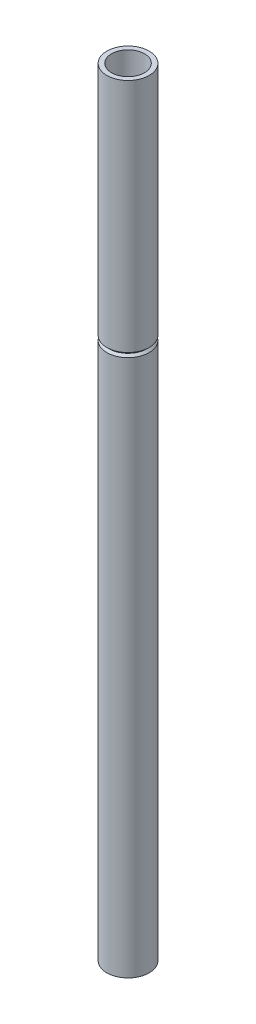
ISO-10303-21;
HEADER;
FILE_DESCRIPTION(('STEP AP214'),'2;1');
FILE_NAME('part.step','',(''),(''),'','','');
FILE_SCHEMA(('AUTOMOTIVE_DESIGN { 1 0 10303 214 1 1 1 1 }'));
ENDSEC;
DATA;
#1=APPLICATION_CONTEXT('core data for automotive mechanical design processes');
#2=APPLICATION_PROTOCOL_DEFINITION('international standard','automotive_design',2000,#1);
#3=PRODUCT_CONTEXT('',#1,'mechanical');
#4=PRODUCT('Part','Part','',(#3));
#5=PRODUCT_RELATED_PRODUCT_CATEGORY('part','',(#4));
#6=PRODUCT_DEFINITION_FORMATION('','',#4);
#7=PRODUCT_DEFINITION_CONTEXT('part definition',#1,'design');
#8=PRODUCT_DEFINITION('design','',#6,#7);
#9=PRODUCT_DEFINITION_SHAPE('','',#8);
#10=(LENGTH_UNIT() NAMED_UNIT(*) SI_UNIT(.MILLI.,.METRE.));
#11=(NAMED_UNIT(*) PLANE_ANGLE_UNIT() SI_UNIT($,.RADIAN.));
#12=(NAMED_UNIT(*) SI_UNIT($,.STERADIAN.) SOLID_ANGLE_UNIT());
#13=UNCERTAINTY_MEASURE_WITH_UNIT(LENGTH_MEASURE(1.E-05),#10,'distance_accuracy_value','');
#14=(GEOMETRIC_REPRESENTATION_CONTEXT(3) GLOBAL_UNCERTAINTY_ASSIGNED_CONTEXT((#13)) GLOBAL_UNIT_ASSIGNED_CONTEXT((#10,
#11,#12)) REPRESENTATION_CONTEXT('',''));
#15=CARTESIAN_POINT('',(0.,0.,0.));
#16=DIRECTION('',(0.,0.,1.));
#17=DIRECTION('',(1.,0.,0.));
#18=AXIS2_PLACEMENT_3D('',#15,#16,#17);
#19=CARTESIAN_POINT('',(0.,0.106318699362486,0.));
#20=DIRECTION('',(0.,1.,0.));
#21=DIRECTION('',(0.,0.,1.));
#22=AXIS2_PLACEMENT_3D('',#19,#20,#21);
#23=CONICAL_SURFACE('',#22,0.53,1.23320369806911);
#24=CARTESIAN_POINT('',(0.,-0.0457218100560409,0.));
#25=DIRECTION('',(0.,-1.,0.));
#26=DIRECTION('',(0.,0.,-1.));
#27=AXIS2_PLACEMENT_3D('',#24,#25,#26);
#28=CIRCLE('',#27,0.0968738810673313);
#29=CARTESIAN_POINT('',(0.,-0.0457218100560409,-0.0968738810673313));
#30=VERTEX_POINT('',#29);
#31=EDGE_CURVE('E71',#30,#30,#28,.T.);
#32=ORIENTED_EDGE('',*,*,#31,.T.);
#33=EDGE_LOOP('',(#32));
#34=FACE_BOUND('',#33,.T.);
#35=CARTESIAN_POINT('',(0.,0.106318699362486,0.));
#36=DIRECTION('',(0.,-1.,0.));
#37=DIRECTION('',(0.,0.,-1.));
#38=AXIS2_PLACEMENT_3D('',#35,#36,#37);
#39=CIRCLE('',#38,0.53);
#40=CARTESIAN_POINT('',(0.,0.106318699362486,-0.53));
#41=VERTEX_POINT('',#40);
#42=EDGE_CURVE('E10',#41,#41,#39,.T.);
#43=ORIENTED_EDGE('',*,*,#42,.F.);
#44=EDGE_LOOP('',(#43));
#45=FACE_BOUND('',#44,.T.);
#46=ADVANCED_FACE('F31',(#34,#45),#23,.F.);
#47=CARTESIAN_POINT('',(0.,0.,0.));
#48=DIRECTION('',(0.,-1.,0.));
#49=DIRECTION('',(0.,0.,-1.));
#50=AXIS2_PLACEMENT_3D('',#47,#48,#49);
#51=CYLINDRICAL_SURFACE('',#50,0.529999999999999);
#52=ORIENTED_EDGE('',*,*,#42,.T.);
#53=EDGE_LOOP('',(#52));
#54=FACE_BOUND('',#53,.T.);
#55=CARTESIAN_POINT('',(0.,17.2171572875254,0.));
#56=DIRECTION('',(0.,-1.,0.));
#57=DIRECTION('',(0.,0.,-1.));
#58=AXIS2_PLACEMENT_3D('',#55,#56,#57);
#59=CIRCLE('',#58,0.529999999999998);
#60=CARTESIAN_POINT('',(0.,17.2171572875254,-0.529999999999998));
#61=VERTEX_POINT('',#60);
#62=EDGE_CURVE('E37',#61,#61,#59,.T.);
#63=ORIENTED_EDGE('',*,*,#62,.F.);
#64=EDGE_LOOP('',(#63));
#65=FACE_BOUND('',#64,.T.);
#66=ADVANCED_FACE('F131',(#54,#65),#51,.F.);
#67=CARTESIAN_POINT('',(0.,17.35,0.));
#68=DIRECTION('',(0.,-1.,0.));
#69=DIRECTION('',(0.,0.,-1.));
#70=AXIS2_PLACEMENT_3D('',#67,#68,#69);
#71=CONICAL_SURFACE('',#70,0.397157287525377,0.785398163397457);
#72=ORIENTED_EDGE('',*,*,#62,.T.);
#73=EDGE_LOOP('',(#72));
#74=FACE_BOUND('',#73,.T.);
#75=CARTESIAN_POINT('',(0.,17.35,0.));
#76=DIRECTION('',(0.,-1.,0.));
#77=DIRECTION('',(0.,0.,-1.));
#78=AXIS2_PLACEMENT_3D('',#75,#76,#77);
#79=CIRCLE('',#78,0.397157287525377);
#80=CARTESIAN_POINT('',(0.,17.35,-0.397157287525377));
#81=VERTEX_POINT('',#80);
#82=EDGE_CURVE('E41',#81,#81,#79,.T.);
#83=ORIENTED_EDGE('',*,*,#82,.F.);
#84=EDGE_LOOP('',(#83));
#85=FACE_BOUND('',#84,.T.);
#86=ADVANCED_FACE('F127',(#74,#85),#71,.F.);
#87=CARTESIAN_POINT('',(0.,17.4828427124746,0.));
#88=DIRECTION('',(0.,1.,0.));
#89=DIRECTION('',(0.,0.,1.));
#90=AXIS2_PLACEMENT_3D('',#87,#88,#89);
#91=CONICAL_SURFACE('',#90,0.529999999999998,0.785398163397457);
#92=ORIENTED_EDGE('',*,*,#82,.T.);
#93=EDGE_LOOP('',(#92));
#94=FACE_BOUND('',#93,.T.);
#95=CARTESIAN_POINT('',(0.,17.4828427124746,0.));
#96=DIRECTION('',(0.,-1.,0.));
#97=DIRECTION('',(0.,0.,-1.));
#98=AXIS2_PLACEMENT_3D('',#95,#96,#97);
#99=CIRCLE('',#98,0.529999999999998);
#100=CARTESIAN_POINT('',(0.,17.4828427124746,-0.529999999999998));
#101=VERTEX_POINT('',#100);
#102=EDGE_CURVE('E45',#101,#101,#99,.T.);
#103=ORIENTED_EDGE('',*,*,#102,.F.);
#104=EDGE_LOOP('',(#103));
#105=FACE_BOUND('',#104,.T.);
#106=ADVANCED_FACE('F121',(#94,#105),#91,.F.);
#107=CARTESIAN_POINT('',(0.,0.,0.));
#108=DIRECTION('',(0.,-1.,0.));
#109=DIRECTION('',(0.,0.,-1.));
#110=AXIS2_PLACEMENT_3D('',#107,#108,#109);
#111=CYLINDRICAL_SURFACE('',#110,0.529999999999998);
#112=ORIENTED_EDGE('',*,*,#102,.T.);
#113=EDGE_LOOP('',(#112));
#114=FACE_BOUND('',#113,.T.);
#115=CARTESIAN_POINT('',(0.,25.,0.));
#116=DIRECTION('',(0.,-1.,0.));
#117=DIRECTION('',(0.,0.,-1.));
#118=AXIS2_PLACEMENT_3D('',#115,#116,#117);
#119=CIRCLE('',#118,0.529999999999997);
#120=CARTESIAN_POINT('',(0.,25.,-0.529999999999997));
#121=VERTEX_POINT('',#120);
#122=EDGE_CURVE('E50',#121,#121,#119,.T.);
#123=ORIENTED_EDGE('',*,*,#122,.F.);
#124=EDGE_LOOP('',(#123));
#125=FACE_BOUND('',#124,.T.);
#126=ADVANCED_FACE('F116',(#114,#125),#111,.F.);
#127=CARTESIAN_POINT('',(0.529999999999997,25.,0.));
#128=DIRECTION('',(0.,-1.,0.));
#129=DIRECTION('',(0.,0.,-1.));
#130=AXIS2_PLACEMENT_3D('',#127,#128,#129);
#131=PLANE('',#130);
#132=CARTESIAN_POINT('',(0.,25.,0.));
#133=DIRECTION('',(0.,-1.,0.));
#134=DIRECTION('',(0.,0.,-1.));
#135=AXIS2_PLACEMENT_3D('',#132,#133,#134);
#136=CIRCLE('',#135,0.679999999999997);
#137=CARTESIAN_POINT('',(0.,25.,-0.679999999999997));
#138=VERTEX_POINT('',#137);
#139=EDGE_CURVE('E53',#138,#138,#136,.T.);
#140=ORIENTED_EDGE('',*,*,#139,.F.);
#141=EDGE_LOOP('',(#140));
#142=FACE_BOUND('',#141,.T.);
#143=ORIENTED_EDGE('',*,*,#122,.T.);
#144=EDGE_LOOP('',(#143));
#145=FACE_BOUND('',#144,.T.);
#146=ADVANCED_FACE('F110',(#142,#145),#131,.F.);
#147=CARTESIAN_POINT('',(0.,0.,0.));
#148=DIRECTION('',(0.,-1.,0.));
#149=DIRECTION('',(0.,0.,-1.));
#150=AXIS2_PLACEMENT_3D('',#147,#148,#149);
#151=CYLINDRICAL_SURFACE('',#150,0.679999999999998);
#152=CARTESIAN_POINT('',(0.,17.4207106781187,0.));
#153=DIRECTION('',(0.,-1.,0.));
#154=DIRECTION('',(0.,0.,-1.));
#155=AXIS2_PLACEMENT_3D('',#152,#153,#154);
#156=CIRCLE('',#155,0.679999999999998);
#157=CARTESIAN_POINT('',(0.,17.4207106781187,-0.679999999999998));
#158=VERTEX_POINT('',#157);
#159=EDGE_CURVE('E56',#158,#158,#156,.T.);
#160=ORIENTED_EDGE('',*,*,#159,.F.);
#161=EDGE_LOOP('',(#160));
#162=FACE_BOUND('',#161,.T.);
#163=ORIENTED_EDGE('',*,*,#139,.T.);
#164=EDGE_LOOP('',(#163));
#165=FACE_BOUND('',#164,.T.);
#166=ADVANCED_FACE('F104',(#162,#165),#151,.T.);
#167=CARTESIAN_POINT('',(0.,17.4207106781187,0.));
#168=DIRECTION('',(0.,1.,0.));
#169=DIRECTION('',(0.,0.,1.));
#170=AXIS2_PLACEMENT_3D('',#167,#168,#169);
#171=CONICAL_SURFACE('',#170,0.679999999999998,0.785398163397458);
#172=CARTESIAN_POINT('',(0.,17.35,0.));
#173=DIRECTION('',(0.,-1.,0.));
#174=DIRECTION('',(0.,0.,-1.));
#175=AXIS2_PLACEMENT_3D('',#172,#173,#174);
#176=CIRCLE('',#175,0.609289321881344);
#177=CARTESIAN_POINT('',(0.,17.35,-0.609289321881344));
#178=VERTEX_POINT('',#177);
#179=EDGE_CURVE('E59',#178,#178,#176,.T.);
#180=ORIENTED_EDGE('',*,*,#179,.F.);
#181=EDGE_LOOP('',(#180));
#182=FACE_BOUND('',#181,.T.);
#183=ORIENTED_EDGE('',*,*,#159,.T.);
#184=EDGE_LOOP('',(#183));
#185=FACE_BOUND('',#184,.T.);
#186=ADVANCED_FACE('F98',(#182,#185),#171,.T.);
#187=CARTESIAN_POINT('',(0.,17.35,0.));
#188=DIRECTION('',(0.,-1.,0.));
#189=DIRECTION('',(0.,0.,-1.));
#190=AXIS2_PLACEMENT_3D('',#187,#188,#189);
#191=CONICAL_SURFACE('',#190,0.609289321881344,0.785398163397458);
#192=CARTESIAN_POINT('',(0.,17.2792893218813,0.));
#193=DIRECTION('',(0.,-1.,0.));
#194=DIRECTION('',(0.,0.,-1.));
#195=AXIS2_PLACEMENT_3D('',#192,#193,#194);
#196=CIRCLE('',#195,0.679999999999998);
#197=CARTESIAN_POINT('',(0.,17.2792893218813,-0.679999999999998));
#198=VERTEX_POINT('',#197);
#199=EDGE_CURVE('E62',#198,#198,#196,.T.);
#200=ORIENTED_EDGE('',*,*,#199,.F.);
#201=EDGE_LOOP('',(#200));
#202=FACE_BOUND('',#201,.T.);
#203=ORIENTED_EDGE('',*,*,#179,.T.);
#204=EDGE_LOOP('',(#203));
#205=FACE_BOUND('',#204,.T.);
#206=ADVANCED_FACE('F92',(#202,#205),#191,.T.);
#207=CARTESIAN_POINT('',(0.,0.,0.));
#208=DIRECTION('',(0.,-1.,0.));
#209=DIRECTION('',(0.,0.,-1.));
#210=AXIS2_PLACEMENT_3D('',#207,#208,#209);
#211=CYLINDRICAL_SURFACE('',#210,0.679999999999999);
#212=CARTESIAN_POINT('',(0.,0.,0.));
#213=DIRECTION('',(0.,-1.,0.));
#214=DIRECTION('',(0.,0.,-1.));
#215=AXIS2_PLACEMENT_3D('',#212,#213,#214);
#216=CIRCLE('',#215,0.68);
#217=CARTESIAN_POINT('',(0.,0.,-0.68));
#218=VERTEX_POINT('',#217);
#219=EDGE_CURVE('E65',#218,#218,#216,.T.);
#220=ORIENTED_EDGE('',*,*,#219,.F.);
#221=EDGE_LOOP('',(#220));
#222=FACE_BOUND('',#221,.T.);
#223=ORIENTED_EDGE('',*,*,#199,.T.);
#224=EDGE_LOOP('',(#223));
#225=FACE_BOUND('',#224,.T.);
#226=ADVANCED_FACE('F86',(#222,#225),#211,.T.);
#227=CARTESIAN_POINT('',(0.,0.,0.));
#228=DIRECTION('',(0.,1.,0.));
#229=DIRECTION('',(0.,0.,1.));
#230=AXIS2_PLACEMENT_3D('',#227,#228,#229);
#231=CONICAL_SURFACE('',#230,0.68,1.23320369806911);
#232=CARTESIAN_POINT('',(0.,-0.187255024080457,0.));
#233=DIRECTION('',(0.,-1.,0.));
#234=DIRECTION('',(0.,0.,-1.));
#235=AXIS2_PLACEMENT_3D('',#232,#233,#234);
#236=CIRCLE('',#235,0.146556366189543);
#237=CARTESIAN_POINT('',(0.,-0.187255024080457,-0.146556366189543));
#238=VERTEX_POINT('',#237);
#239=EDGE_CURVE('E68',#238,#238,#236,.T.);
#240=ORIENTED_EDGE('',*,*,#239,.F.);
#241=EDGE_LOOP('',(#240));
#242=FACE_BOUND('',#241,.T.);
#243=ORIENTED_EDGE('',*,*,#219,.T.);
#244=EDGE_LOOP('',(#243));
#245=FACE_BOUND('',#244,.T.);
#246=ADVANCED_FACE('F80',(#242,#245),#231,.T.);
#247=CARTESIAN_POINT('',(0.,-0.187255024080457,0.));
#248=DIRECTION('',(0.,-1.,0.));
#249=DIRECTION('',(0.,0.,-1.));
#250=AXIS2_PLACEMENT_3D('',#247,#248,#249);
#251=CONICAL_SURFACE('',#250,0.146556366189543,0.337592628725784);
#252=ORIENTED_EDGE('',*,*,#31,.F.);
#253=EDGE_LOOP('',(#252));
#254=FACE_BOUND('',#253,.T.);
#255=ORIENTED_EDGE('',*,*,#239,.T.);
#256=EDGE_LOOP('',(#255));
#257=FACE_BOUND('',#256,.T.);
#258=ADVANCED_FACE('F77',(#254,#257),#251,.F.);
#259=CLOSED_SHELL('',(#46,#66,#86,#106,#126,#146,#166,#186,#206,#226,#246,#258));
#260=MANIFOLD_SOLID_BREP('B2',#259);
#261=ADVANCED_BREP_SHAPE_REPRESENTATION('',(#18,#260),#14);
#262=SHAPE_DEFINITION_REPRESENTATION(#9,#261);
ENDSEC;
END-ISO-10303-21;
